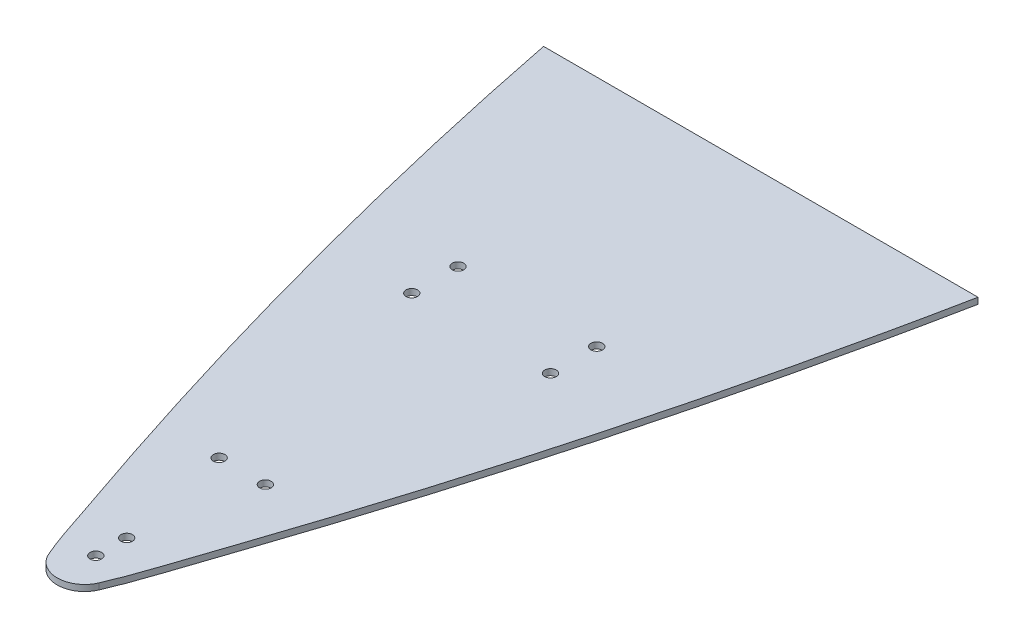
ISO-10303-21;
HEADER;
FILE_DESCRIPTION(('STEP AP214'),'2;1');
FILE_NAME('part.step','',(''),(''),'','','');
FILE_SCHEMA(('AUTOMOTIVE_DESIGN { 1 0 10303 214 1 1 1 1 }'));
ENDSEC;
DATA;
#1=APPLICATION_CONTEXT('core data for automotive mechanical design processes');
#2=APPLICATION_PROTOCOL_DEFINITION('international standard','automotive_design',2000,#1);
#3=PRODUCT_CONTEXT('',#1,'mechanical');
#4=PRODUCT('Part','Part','',(#3));
#5=PRODUCT_RELATED_PRODUCT_CATEGORY('part','',(#4));
#6=PRODUCT_DEFINITION_FORMATION('','',#4);
#7=PRODUCT_DEFINITION_CONTEXT('part definition',#1,'design');
#8=PRODUCT_DEFINITION('design','',#6,#7);
#9=PRODUCT_DEFINITION_SHAPE('','',#8);
#10=(LENGTH_UNIT() NAMED_UNIT(*) SI_UNIT(.MILLI.,.METRE.));
#11=(NAMED_UNIT(*) PLANE_ANGLE_UNIT() SI_UNIT($,.RADIAN.));
#12=(NAMED_UNIT(*) SI_UNIT($,.STERADIAN.) SOLID_ANGLE_UNIT());
#13=UNCERTAINTY_MEASURE_WITH_UNIT(LENGTH_MEASURE(1.E-05),#10,'distance_accuracy_value','');
#14=(GEOMETRIC_REPRESENTATION_CONTEXT(3) GLOBAL_UNCERTAINTY_ASSIGNED_CONTEXT((#13)) GLOBAL_UNIT_ASSIGNED_CONTEXT((#10,
#11,#12)) REPRESENTATION_CONTEXT('',''));
#15=CARTESIAN_POINT('',(0.,0.,0.));
#16=DIRECTION('',(0.,0.,1.));
#17=DIRECTION('',(1.,0.,0.));
#18=AXIS2_PLACEMENT_3D('',#15,#16,#17);
#19=CARTESIAN_POINT('',(-102.894174680882,0.,1064.17982041318));
#20=DIRECTION('',(0.,-1.,0.));
#21=DIRECTION('',(0.,0.,-1.));
#22=AXIS2_PLACEMENT_3D('',#19,#20,#21);
#23=PLANE('',#22);
#24=CARTESIAN_POINT('',(64.8682229055531,0.,970.442033990194));
#25=DIRECTION('',(0.,1.,0.));
#26=DIRECTION('',(0.,0.,1.));
#27=AXIS2_PLACEMENT_3D('',#24,#25,#26);
#28=CIRCLE('',#27,4.76249999999999);
#29=CARTESIAN_POINT('',(64.8682229055531,0.,975.204533990194));
#30=VERTEX_POINT('',#29);
#31=EDGE_CURVE('E132',#30,#30,#28,.T.);
#32=ORIENTED_EDGE('',*,*,#31,.T.);
#33=EDGE_LOOP('',(#32));
#34=FACE_BOUND('',#33,.T.);
#35=CARTESIAN_POINT('',(64.8682229055531,0.,1008.54203399019));
#36=DIRECTION('',(0.,1.,0.));
#37=DIRECTION('',(0.,0.,1.));
#38=AXIS2_PLACEMENT_3D('',#35,#36,#37);
#39=CIRCLE('',#38,4.76249999999999);
#40=CARTESIAN_POINT('',(64.8682229055531,0.,1013.30453399019));
#41=VERTEX_POINT('',#40);
#42=EDGE_CURVE('E136',#41,#41,#39,.T.);
#43=ORIENTED_EDGE('',*,*,#42,.T.);
#44=EDGE_LOOP('',(#43));
#45=FACE_BOUND('',#44,.T.);
#46=CARTESIAN_POINT('',(-11.3317770944469,0.,1205.39203399019));
#47=DIRECTION('',(0.,1.,0.));
#48=DIRECTION('',(0.,0.,1.));
#49=AXIS2_PLACEMENT_3D('',#46,#47,#48);
#50=CIRCLE('',#49,4.76249999999999);
#51=CARTESIAN_POINT('',(-11.3317770944469,0.,1210.15453399019));
#52=VERTEX_POINT('',#51);
#53=EDGE_CURVE('E140',#52,#52,#50,.T.);
#54=ORIENTED_EDGE('',*,*,#53,.T.);
#55=EDGE_LOOP('',(#54));
#56=FACE_BOUND('',#55,.T.);
#57=CARTESIAN_POINT('',(26.7682229055531,0.,1205.39203399019));
#58=DIRECTION('',(0.,1.,0.));
#59=DIRECTION('',(0.,0.,1.));
#60=AXIS2_PLACEMENT_3D('',#57,#58,#59);
#61=CIRCLE('',#60,4.76249999999999);
#62=CARTESIAN_POINT('',(26.7682229055531,0.,1210.15453399019));
#63=VERTEX_POINT('',#62);
#64=EDGE_CURVE('E144',#63,#63,#61,.T.);
#65=ORIENTED_EDGE('',*,*,#64,.T.);
#66=EDGE_LOOP('',(#65));
#67=FACE_BOUND('',#66,.T.);
#68=CARTESIAN_POINT('',(7.71822289655356,0.,1326.04203399019));
#69=DIRECTION('',(0.,1.,0.));
#70=DIRECTION('',(0.,0.,1.));
#71=AXIS2_PLACEMENT_3D('',#68,#69,#70);
#72=CIRCLE('',#71,4.7625);
#73=CARTESIAN_POINT('',(7.71822289655356,0.,1330.80453399019));
#74=VERTEX_POINT('',#73);
#75=EDGE_CURVE('E148',#74,#74,#72,.T.);
#76=ORIENTED_EDGE('',*,*,#75,.T.);
#77=EDGE_LOOP('',(#76));
#78=FACE_BOUND('',#77,.T.);
#79=DIRECTION('',(-1.,0.,0.));
#80=VECTOR('',#79,1.);
#81=CARTESIAN_POINT('',(186.706216966435,0.,778.102360843594));
#82=LINE('',#81,#80);
#83=CARTESIAN_POINT('',(186.706216966435,0.,778.102360843594));
#84=VERTEX_POINT('',#83);
#85=CARTESIAN_POINT('',(-171.26977115294,0.,778.102360843594));
#86=VERTEX_POINT('',#85);
#87=EDGE_CURVE('E104',#84,#86,#82,.T.);
#88=ORIENTED_EDGE('',*,*,#87,.F.);
#89=CARTESIAN_POINT('',(28.3542757225998,0.,1344.24219916437));
#90=CARTESIAN_POINT('',(38.1207256580642,0.,1321.69638185781));
#91=CARTESIAN_POINT('',(44.9392376613763,0.,1298.07936917304));
#92=CARTESIAN_POINT('',(60.8236541705662,0.,1251.67163935085));
#93=CARTESIAN_POINT('',(68.5444968788546,0.,1228.39343109724));
#94=CARTESIAN_POINT('',(91.0291943734099,0.,1158.3687064779));
#95=CARTESIAN_POINT('',(105.122355407297,0.,1111.42027464895));
#96=CARTESIAN_POINT('',(144.723795490561,0.,969.78264447684));
#97=CARTESIAN_POINT('',(167.537266257408,0.,874.315888922943));
#98=CARTESIAN_POINT('',(186.706216966435,0.,778.102360843594));
#99=B_SPLINE_CURVE_WITH_KNOTS('',3,(#89,#90,#91,#92,#93,#94,#95,#96,#97,#98),.UNSPECIFIED.,.F.,
.F.,(4,2,2,2,4),(0.,0.125,0.25,0.500000000000001,1.),.UNSPECIFIED.);
#100=CARTESIAN_POINT('',(28.3542757225998,0.,1344.24219916437));
#101=VERTEX_POINT('',#100);
#102=EDGE_CURVE('E73',#101,#84,#99,.T.);
#103=ORIENTED_EDGE('',*,*,#102,.F.);
#104=CARTESIAN_POINT('',(7.71822290555313,0.,1335.30302554437));
#105=DIRECTION('',(0.,1.,0.));
#106=DIRECTION('',(0.,0.,1.));
#107=AXIS2_PLACEMENT_3D('',#104,#105,#106);
#108=CIRCLE('',#107,22.4890084458271);
#109=CARTESIAN_POINT('',(-12.917829918648,0.,1344.24219914785));
#110=VERTEX_POINT('',#109);
#111=EDGE_CURVE('E67',#110,#101,#108,.T.);
#112=ORIENTED_EDGE('',*,*,#111,.F.);
#113=CARTESIAN_POINT('',(-171.26977115294,0.,778.102360843594));
#114=CARTESIAN_POINT('',(-159.707774453954,0.,836.134775395318));
#115=CARTESIAN_POINT('',(-146.818924840319,0.,893.918808199758));
#116=CARTESIAN_POINT('',(-132.6111037686,0.,951.360767834901));
#117=CARTESIAN_POINT('',(-118.403260068234,0.,1008.80281895725));
#118=CARTESIAN_POINT('',(-102.873342201812,0.,1065.93390314373));
#119=CARTESIAN_POINT('',(-86.0455697857269,0.,1122.66377301198));
#120=CARTESIAN_POINT('',(-74.9900897613995,0.,1159.93406212711));
#121=CARTESIAN_POINT('',(-63.3712813173319,0.,1197.04190708083));
#122=CARTESIAN_POINT('',(-51.1942154447985,0.,1233.96096931201));
#123=CARTESIAN_POINT('',(-45.1005671975206,0.,1252.43600929382));
#124=CARTESIAN_POINT('',(-38.8668414313704,0.,1270.86543042096));
#125=CARTESIAN_POINT('',(-32.4945995828439,0.,1289.24624066194));
#126=CARTESIAN_POINT('',(-26.1207972017195,0.,1307.63155227845));
#127=CARTESIAN_POINT('',(-20.6525250470129,0.,1326.38668091675));
#128=CARTESIAN_POINT('',(-12.917829918648,0.,1344.24219914785));
#129=B_SPLINE_CURVE_WITH_KNOTS('',3,(#113,#114,#115,#116,#117,#118,#119,#120,#121,#122,#123,
#124,#125,#126,#127,#128),.UNSPECIFIED.,.F.,.F.,(4,3,3,3,3,4),(0.,0.17751892337715,
0.355038120898129,0.471646971811116,0.529995372212987,0.588358391287499),.UNSPECIFIED.);
#130=EDGE_CURVE('E90',#86,#110,#129,.T.);
#131=ORIENTED_EDGE('',*,*,#130,.F.);
#132=EDGE_LOOP('',(#88,#103,#112,#131));
#133=FACE_BOUND('',#132,.T.);
#134=CARTESIAN_POINT('',(7.71822289655356,0.,1300.64203399019));
#135=DIRECTION('',(0.,1.,0.));
#136=DIRECTION('',(0.,0.,1.));
#137=AXIS2_PLACEMENT_3D('',#134,#135,#136);
#138=CIRCLE('',#137,4.7625);
#139=CARTESIAN_POINT('',(7.71822289655356,0.,1305.40453399019));
#140=VERTEX_POINT('',#139);
#141=EDGE_CURVE('E155',#140,#140,#138,.T.);
#142=ORIENTED_EDGE('',*,*,#141,.T.);
#143=EDGE_LOOP('',(#142));
#144=FACE_BOUND('',#143,.T.);
#145=CARTESIAN_POINT('',(-49.4317770944469,0.,1008.54203399019));
#146=DIRECTION('',(0.,1.,0.));
#147=DIRECTION('',(0.,0.,1.));
#148=AXIS2_PLACEMENT_3D('',#145,#146,#147);
#149=CIRCLE('',#148,4.76249999999999);
#150=CARTESIAN_POINT('',(-49.4317770944469,0.,1013.30453399019));
#151=VERTEX_POINT('',#150);
#152=EDGE_CURVE('E159',#151,#151,#149,.T.);
#153=ORIENTED_EDGE('',*,*,#152,.T.);
#154=EDGE_LOOP('',(#153));
#155=FACE_BOUND('',#154,.T.);
#156=CARTESIAN_POINT('',(-49.4317770944469,0.,970.442033990194));
#157=DIRECTION('',(0.,1.,0.));
#158=DIRECTION('',(0.,0.,1.));
#159=AXIS2_PLACEMENT_3D('',#156,#157,#158);
#160=CIRCLE('',#159,4.76249999999999);
#161=CARTESIAN_POINT('',(-49.4317770944469,0.,975.204533990194));
#162=VERTEX_POINT('',#161);
#163=EDGE_CURVE('E162',#162,#162,#160,.T.);
#164=ORIENTED_EDGE('',*,*,#163,.T.);
#165=EDGE_LOOP('',(#164));
#166=FACE_BOUND('',#165,.T.);
#167=ADVANCED_FACE('F33',(#34,#45,#56,#67,#78,#133,#144,#155,#166),#23,.T.);
#168=CARTESIAN_POINT('',(-102.894174680882,5.08,1064.17982041318));
#169=DIRECTION('',(0.,-1.,0.));
#170=DIRECTION('',(0.,0.,-1.));
#171=AXIS2_PLACEMENT_3D('',#168,#169,#170);
#172=PLANE('',#171);
#173=CARTESIAN_POINT('',(-49.4317770944469,5.08,970.442033990194));
#174=DIRECTION('',(0.,1.,0.));
#175=DIRECTION('',(0.,0.,1.));
#176=AXIS2_PLACEMENT_3D('',#173,#174,#175);
#177=CIRCLE('',#176,4.76249999999999);
#178=CARTESIAN_POINT('',(-49.4317770944469,5.08,975.204533990194));
#179=VERTEX_POINT('',#178);
#180=EDGE_CURVE('E165',#179,#179,#177,.T.);
#181=ORIENTED_EDGE('',*,*,#180,.F.);
#182=EDGE_LOOP('',(#181));
#183=FACE_BOUND('',#182,.T.);
#184=CARTESIAN_POINT('',(64.8682229055531,5.08,970.442033990194));
#185=DIRECTION('',(0.,1.,0.));
#186=DIRECTION('',(0.,0.,1.));
#187=AXIS2_PLACEMENT_3D('',#184,#185,#186);
#188=CIRCLE('',#187,4.76249999999999);
#189=CARTESIAN_POINT('',(64.8682229055531,5.08,975.204533990194));
#190=VERTEX_POINT('',#189);
#191=EDGE_CURVE('E173',#190,#190,#188,.T.);
#192=ORIENTED_EDGE('',*,*,#191,.F.);
#193=EDGE_LOOP('',(#192));
#194=FACE_BOUND('',#193,.T.);
#195=CARTESIAN_POINT('',(64.8682229055531,5.08,1008.54203399019));
#196=DIRECTION('',(0.,1.,0.));
#197=DIRECTION('',(0.,0.,1.));
#198=AXIS2_PLACEMENT_3D('',#195,#196,#197);
#199=CIRCLE('',#198,4.76249999999999);
#200=CARTESIAN_POINT('',(64.8682229055531,5.08,1013.30453399019));
#201=VERTEX_POINT('',#200);
#202=EDGE_CURVE('E177',#201,#201,#199,.T.);
#203=ORIENTED_EDGE('',*,*,#202,.F.);
#204=EDGE_LOOP('',(#203));
#205=FACE_BOUND('',#204,.T.);
#206=CARTESIAN_POINT('',(-11.3317770944469,5.08,1205.39203399019));
#207=DIRECTION('',(0.,1.,0.));
#208=DIRECTION('',(0.,0.,1.));
#209=AXIS2_PLACEMENT_3D('',#206,#207,#208);
#210=CIRCLE('',#209,4.76249999999999);
#211=CARTESIAN_POINT('',(-11.3317770944469,5.08,1210.15453399019));
#212=VERTEX_POINT('',#211);
#213=EDGE_CURVE('E181',#212,#212,#210,.T.);
#214=ORIENTED_EDGE('',*,*,#213,.F.);
#215=EDGE_LOOP('',(#214));
#216=FACE_BOUND('',#215,.T.);
#217=CARTESIAN_POINT('',(7.71822289655356,5.08,1326.04203399019));
#218=DIRECTION('',(0.,1.,0.));
#219=DIRECTION('',(0.,0.,1.));
#220=AXIS2_PLACEMENT_3D('',#217,#218,#219);
#221=CIRCLE('',#220,4.7625);
#222=CARTESIAN_POINT('',(7.71822289655356,5.08,1330.80453399019));
#223=VERTEX_POINT('',#222);
#224=EDGE_CURVE('E189',#223,#223,#221,.T.);
#225=ORIENTED_EDGE('',*,*,#224,.F.);
#226=EDGE_LOOP('',(#225));
#227=FACE_BOUND('',#226,.T.);
#228=CARTESIAN_POINT('',(7.71822289655356,5.08,1300.64203399019));
#229=DIRECTION('',(0.,1.,0.));
#230=DIRECTION('',(0.,0.,1.));
#231=AXIS2_PLACEMENT_3D('',#228,#229,#230);
#232=CIRCLE('',#231,4.7625);
#233=CARTESIAN_POINT('',(7.71822289655356,5.08,1305.40453399019));
#234=VERTEX_POINT('',#233);
#235=EDGE_CURVE('E193',#234,#234,#232,.T.);
#236=ORIENTED_EDGE('',*,*,#235,.F.);
#237=EDGE_LOOP('',(#236));
#238=FACE_BOUND('',#237,.T.);
#239=DIRECTION('',(-1.,0.,0.));
#240=VECTOR('',#239,1.);
#241=CARTESIAN_POINT('',(186.706216966435,5.08,778.102360843594));
#242=LINE('',#241,#240);
#243=CARTESIAN_POINT('',(186.706216966435,5.08,778.102360843594));
#244=VERTEX_POINT('',#243);
#245=CARTESIAN_POINT('',(-171.26977115294,5.08,778.102360843594));
#246=VERTEX_POINT('',#245);
#247=EDGE_CURVE('E86',#244,#246,#242,.T.);
#248=ORIENTED_EDGE('',*,*,#247,.T.);
#249=CARTESIAN_POINT('',(-171.26977115294,5.08,778.102360843594));
#250=CARTESIAN_POINT('',(-159.707774453954,5.08,836.134775395318));
#251=CARTESIAN_POINT('',(-146.818924840319,5.08,893.918808199758));
#252=CARTESIAN_POINT('',(-132.6111037686,5.08,951.360767834901));
#253=CARTESIAN_POINT('',(-118.403260068234,5.08,1008.80281895725));
#254=CARTESIAN_POINT('',(-102.873342201812,5.08,1065.93390314373));
#255=CARTESIAN_POINT('',(-86.0455697857269,5.08,1122.66377301198));
#256=CARTESIAN_POINT('',(-74.9900897613995,5.08,1159.93406212711));
#257=CARTESIAN_POINT('',(-63.3712813173319,5.08,1197.04190708083));
#258=CARTESIAN_POINT('',(-51.1942154447985,5.08,1233.96096931201));
#259=CARTESIAN_POINT('',(-45.1005671975206,5.08,1252.43600929382));
#260=CARTESIAN_POINT('',(-38.8668414313704,5.08,1270.86543042096));
#261=CARTESIAN_POINT('',(-32.4945995828439,5.08,1289.24624066194));
#262=CARTESIAN_POINT('',(-26.1207972017195,5.08,1307.63155227845));
#263=CARTESIAN_POINT('',(-20.6525250470129,5.08,1326.38668091675));
#264=CARTESIAN_POINT('',(-12.917829918648,5.08,1344.24219914785));
#265=B_SPLINE_CURVE_WITH_KNOTS('',3,(#249,#250,#251,#252,#253,#254,#255,#256,#257,#258,#259,
#260,#261,#262,#263,#264),.UNSPECIFIED.,.F.,.F.,(4,3,3,3,3,4),(0.,0.17751892337715,
0.355038120898129,0.471646971811116,0.529995372212987,0.588358391287499),.UNSPECIFIED.);
#266=CARTESIAN_POINT('',(-12.917829918648,5.08,1344.24219914785));
#267=VERTEX_POINT('',#266);
#268=EDGE_CURVE('E80',#246,#267,#265,.T.);
#269=ORIENTED_EDGE('',*,*,#268,.T.);
#270=CARTESIAN_POINT('',(7.71822290555313,5.08,1335.30302554437));
#271=DIRECTION('',(0.,1.,0.));
#272=DIRECTION('',(0.,0.,1.));
#273=AXIS2_PLACEMENT_3D('',#270,#271,#272);
#274=CIRCLE('',#273,22.4890084458271);
#275=CARTESIAN_POINT('',(28.3542757225998,5.08,1344.24219916437));
#276=VERTEX_POINT('',#275);
#277=EDGE_CURVE('E84',#267,#276,#274,.T.);
#278=ORIENTED_EDGE('',*,*,#277,.T.);
#279=CARTESIAN_POINT('',(28.3542757225998,5.08,1344.24219916437));
#280=CARTESIAN_POINT('',(38.1207256580642,5.08,1321.69638185781));
#281=CARTESIAN_POINT('',(44.9392376613763,5.08,1298.07936917304));
#282=CARTESIAN_POINT('',(60.8236541705662,5.08,1251.67163935085));
#283=CARTESIAN_POINT('',(68.5444968788546,5.08,1228.39343109724));
#284=CARTESIAN_POINT('',(91.0291943734099,5.08,1158.3687064779));
#285=CARTESIAN_POINT('',(105.122355407297,5.08,1111.42027464895));
#286=CARTESIAN_POINT('',(144.723795490561,5.08,969.78264447684));
#287=CARTESIAN_POINT('',(167.537266257408,5.08,874.315888922943));
#288=CARTESIAN_POINT('',(186.706216966435,5.08,778.102360843594));
#289=B_SPLINE_CURVE_WITH_KNOTS('',3,(#279,#280,#281,#282,#283,#284,#285,#286,#287,#288),
.UNSPECIFIED.,.F.,.F.,(4,2,2,2,4),(0.,0.125,0.25,0.500000000000001,1.),.UNSPECIFIED.);
#290=EDGE_CURVE('E50',#276,#244,#289,.T.);
#291=ORIENTED_EDGE('',*,*,#290,.T.);
#292=EDGE_LOOP('',(#248,#269,#278,#291));
#293=FACE_BOUND('',#292,.T.);
#294=CARTESIAN_POINT('',(26.7682229055531,5.08,1205.39203399019));
#295=DIRECTION('',(0.,1.,0.));
#296=DIRECTION('',(0.,0.,1.));
#297=AXIS2_PLACEMENT_3D('',#294,#295,#296);
#298=CIRCLE('',#297,4.76249999999999);
#299=CARTESIAN_POINT('',(26.7682229055531,5.08,1210.15453399019));
#300=VERTEX_POINT('',#299);
#301=EDGE_CURVE('E185',#300,#300,#298,.T.);
#302=ORIENTED_EDGE('',*,*,#301,.F.);
#303=EDGE_LOOP('',(#302));
#304=FACE_BOUND('',#303,.T.);
#305=CARTESIAN_POINT('',(-49.4317770944469,5.08,1008.54203399019));
#306=DIRECTION('',(0.,1.,0.));
#307=DIRECTION('',(0.,0.,1.));
#308=AXIS2_PLACEMENT_3D('',#305,#306,#307);
#309=CIRCLE('',#308,4.76249999999999);
#310=CARTESIAN_POINT('',(-49.4317770944469,5.08,1013.30453399019));
#311=VERTEX_POINT('',#310);
#312=EDGE_CURVE('E164',#311,#311,#309,.T.);
#313=ORIENTED_EDGE('',*,*,#312,.F.);
#314=EDGE_LOOP('',(#313));
#315=FACE_BOUND('',#314,.T.);
#316=ADVANCED_FACE('F81',(#183,#194,#205,#216,#227,#238,#293,#304,#315),#172,.F.);
#317=CARTESIAN_POINT('',(186.706216966435,5.08,778.102360843594));
#318=DIRECTION('',(0.,0.,1.));
#319=DIRECTION('',(1.,0.,0.));
#320=AXIS2_PLACEMENT_3D('',#317,#318,#319);
#321=PLANE('',#320);
#322=ORIENTED_EDGE('',*,*,#87,.T.);
#323=DIRECTION('',(0.,-1.,0.));
#324=VECTOR('',#323,1.);
#325=CARTESIAN_POINT('',(-171.26977115294,5.08,778.102360843594));
#326=LINE('',#325,#324);
#327=EDGE_CURVE('E11',#246,#86,#326,.T.);
#328=ORIENTED_EDGE('',*,*,#327,.F.);
#329=ORIENTED_EDGE('',*,*,#247,.F.);
#330=DIRECTION('',(0.,-1.,0.));
#331=VECTOR('',#330,1.);
#332=CARTESIAN_POINT('',(186.706216966435,5.08,778.102360843594));
#333=LINE('',#332,#331);
#334=EDGE_CURVE('E94',#244,#84,#333,.T.);
#335=ORIENTED_EDGE('',*,*,#334,.T.);
#336=EDGE_LOOP('',(#322,#328,#329,#335));
#337=FACE_BOUND('',#336,.T.);
#338=ADVANCED_FACE('F35',(#337),#321,.F.);
#339=DIRECTION('',(0.,-1.,0.));
#340=VECTOR('',#339,1.);
#341=SURFACE_OF_LINEAR_EXTRUSION('',#265,#340);
#342=ORIENTED_EDGE('',*,*,#130,.T.);
#343=DIRECTION('',(0.,-1.,0.));
#344=VECTOR('',#343,1.);
#345=CARTESIAN_POINT('',(-12.917829918648,5.08,1344.24219914785));
#346=LINE('',#345,#344);
#347=EDGE_CURVE('E42',#267,#110,#346,.T.);
#348=ORIENTED_EDGE('',*,*,#347,.F.);
#349=ORIENTED_EDGE('',*,*,#268,.F.);
#350=ORIENTED_EDGE('',*,*,#327,.T.);
#351=EDGE_LOOP('',(#342,#348,#349,#350));
#352=FACE_BOUND('',#351,.T.);
#353=ADVANCED_FACE('F89',(#352),#341,.F.);
#354=CARTESIAN_POINT('',(7.71822290555313,5.08,1335.30302554437));
#355=DIRECTION('',(0.,-1.,0.));
#356=DIRECTION('',(0.,0.,-1.));
#357=AXIS2_PLACEMENT_3D('',#354,#355,#356);
#358=CYLINDRICAL_SURFACE('',#357,22.4890084458271);
#359=ORIENTED_EDGE('',*,*,#111,.T.);
#360=DIRECTION('',(0.,-1.,0.));
#361=VECTOR('',#360,1.);
#362=CARTESIAN_POINT('',(28.3542757225998,5.08,1344.24219916437));
#363=LINE('',#362,#361);
#364=EDGE_CURVE('E91',#276,#101,#363,.T.);
#365=ORIENTED_EDGE('',*,*,#364,.F.);
#366=ORIENTED_EDGE('',*,*,#277,.F.);
#367=ORIENTED_EDGE('',*,*,#347,.T.);
#368=EDGE_LOOP('',(#359,#365,#366,#367));
#369=FACE_BOUND('',#368,.T.);
#370=ADVANCED_FACE('F92',(#369),#358,.T.);
#371=DIRECTION('',(0.,-1.,0.));
#372=VECTOR('',#371,1.);
#373=SURFACE_OF_LINEAR_EXTRUSION('',#289,#372);
#374=ORIENTED_EDGE('',*,*,#102,.T.);
#375=ORIENTED_EDGE('',*,*,#334,.F.);
#376=ORIENTED_EDGE('',*,*,#290,.F.);
#377=ORIENTED_EDGE('',*,*,#364,.T.);
#378=EDGE_LOOP('',(#374,#375,#376,#377));
#379=FACE_BOUND('',#378,.T.);
#380=ADVANCED_FACE('F110',(#379),#373,.F.);
#381=CARTESIAN_POINT('',(7.71822289655356,5.08,1300.64203399019));
#382=DIRECTION('',(0.,1.,0.));
#383=DIRECTION('',(0.,0.,1.));
#384=AXIS2_PLACEMENT_3D('',#381,#382,#383);
#385=CYLINDRICAL_SURFACE('',#384,4.7625);
#386=ORIENTED_EDGE('',*,*,#141,.F.);
#387=EDGE_LOOP('',(#386));
#388=FACE_BOUND('',#387,.T.);
#389=ORIENTED_EDGE('',*,*,#235,.T.);
#390=EDGE_LOOP('',(#389));
#391=FACE_BOUND('',#390,.T.);
#392=ADVANCED_FACE('F114',(#388,#391),#385,.F.);
#393=CARTESIAN_POINT('',(7.71822289655356,5.08,1326.04203399019));
#394=DIRECTION('',(0.,1.,0.));
#395=DIRECTION('',(0.,0.,1.));
#396=AXIS2_PLACEMENT_3D('',#393,#394,#395);
#397=CYLINDRICAL_SURFACE('',#396,4.7625);
#398=ORIENTED_EDGE('',*,*,#75,.F.);
#399=EDGE_LOOP('',(#398));
#400=FACE_BOUND('',#399,.T.);
#401=ORIENTED_EDGE('',*,*,#224,.T.);
#402=EDGE_LOOP('',(#401));
#403=FACE_BOUND('',#402,.T.);
#404=ADVANCED_FACE('F214',(#400,#403),#397,.F.);
#405=CARTESIAN_POINT('',(26.7682229055531,5.08,1205.39203399019));
#406=DIRECTION('',(0.,1.,0.));
#407=DIRECTION('',(0.,0.,1.));
#408=AXIS2_PLACEMENT_3D('',#405,#406,#407);
#409=CYLINDRICAL_SURFACE('',#408,4.76249999999999);
#410=ORIENTED_EDGE('',*,*,#64,.F.);
#411=EDGE_LOOP('',(#410));
#412=FACE_BOUND('',#411,.T.);
#413=ORIENTED_EDGE('',*,*,#301,.T.);
#414=EDGE_LOOP('',(#413));
#415=FACE_BOUND('',#414,.T.);
#416=ADVANCED_FACE('F220',(#412,#415),#409,.F.);
#417=CARTESIAN_POINT('',(-11.3317770944469,5.08,1205.39203399019));
#418=DIRECTION('',(0.,1.,0.));
#419=DIRECTION('',(0.,0.,1.));
#420=AXIS2_PLACEMENT_3D('',#417,#418,#419);
#421=CYLINDRICAL_SURFACE('',#420,4.76249999999999);
#422=ORIENTED_EDGE('',*,*,#53,.F.);
#423=EDGE_LOOP('',(#422));
#424=FACE_BOUND('',#423,.T.);
#425=ORIENTED_EDGE('',*,*,#213,.T.);
#426=EDGE_LOOP('',(#425));
#427=FACE_BOUND('',#426,.T.);
#428=ADVANCED_FACE('F226',(#424,#427),#421,.F.);
#429=CARTESIAN_POINT('',(64.8682229055531,5.08,1008.54203399019));
#430=DIRECTION('',(0.,1.,0.));
#431=DIRECTION('',(0.,0.,1.));
#432=AXIS2_PLACEMENT_3D('',#429,#430,#431);
#433=CYLINDRICAL_SURFACE('',#432,4.76249999999999);
#434=ORIENTED_EDGE('',*,*,#42,.F.);
#435=EDGE_LOOP('',(#434));
#436=FACE_BOUND('',#435,.T.);
#437=ORIENTED_EDGE('',*,*,#202,.T.);
#438=EDGE_LOOP('',(#437));
#439=FACE_BOUND('',#438,.T.);
#440=ADVANCED_FACE('F230',(#436,#439),#433,.F.);
#441=CARTESIAN_POINT('',(64.8682229055531,5.08,970.442033990194));
#442=DIRECTION('',(0.,1.,0.));
#443=DIRECTION('',(0.,0.,1.));
#444=AXIS2_PLACEMENT_3D('',#441,#442,#443);
#445=CYLINDRICAL_SURFACE('',#444,4.76249999999999);
#446=ORIENTED_EDGE('',*,*,#31,.F.);
#447=EDGE_LOOP('',(#446));
#448=FACE_BOUND('',#447,.T.);
#449=ORIENTED_EDGE('',*,*,#191,.T.);
#450=EDGE_LOOP('',(#449));
#451=FACE_BOUND('',#450,.T.);
#452=ADVANCED_FACE('F234',(#448,#451),#445,.F.);
#453=CARTESIAN_POINT('',(-49.4317770944469,5.08,1008.54203399019));
#454=DIRECTION('',(0.,1.,0.));
#455=DIRECTION('',(0.,0.,1.));
#456=AXIS2_PLACEMENT_3D('',#453,#454,#455);
#457=CYLINDRICAL_SURFACE('',#456,4.76249999999999);
#458=ORIENTED_EDGE('',*,*,#152,.F.);
#459=EDGE_LOOP('',(#458));
#460=FACE_BOUND('',#459,.T.);
#461=ORIENTED_EDGE('',*,*,#312,.T.);
#462=EDGE_LOOP('',(#461));
#463=FACE_BOUND('',#462,.T.);
#464=ADVANCED_FACE('F238',(#460,#463),#457,.F.);
#465=CARTESIAN_POINT('',(-49.4317770944469,5.08,970.442033990194));
#466=DIRECTION('',(0.,1.,0.));
#467=DIRECTION('',(0.,0.,1.));
#468=AXIS2_PLACEMENT_3D('',#465,#466,#467);
#469=CYLINDRICAL_SURFACE('',#468,4.76249999999999);
#470=ORIENTED_EDGE('',*,*,#163,.F.);
#471=EDGE_LOOP('',(#470));
#472=FACE_BOUND('',#471,.T.);
#473=ORIENTED_EDGE('',*,*,#180,.T.);
#474=EDGE_LOOP('',(#473));
#475=FACE_BOUND('',#474,.T.);
#476=ADVANCED_FACE('F242',(#472,#475),#469,.F.);
#477=CLOSED_SHELL('',(#167,#316,#338,#353,#370,#380,#392,#404,#416,#428,#440,#452,#464,#476));
#478=MANIFOLD_SOLID_BREP('B2',#477);
#479=ADVANCED_BREP_SHAPE_REPRESENTATION('',(#18,#478),#14);
#480=SHAPE_DEFINITION_REPRESENTATION(#9,#479);
ENDSEC;
END-ISO-10303-21;
